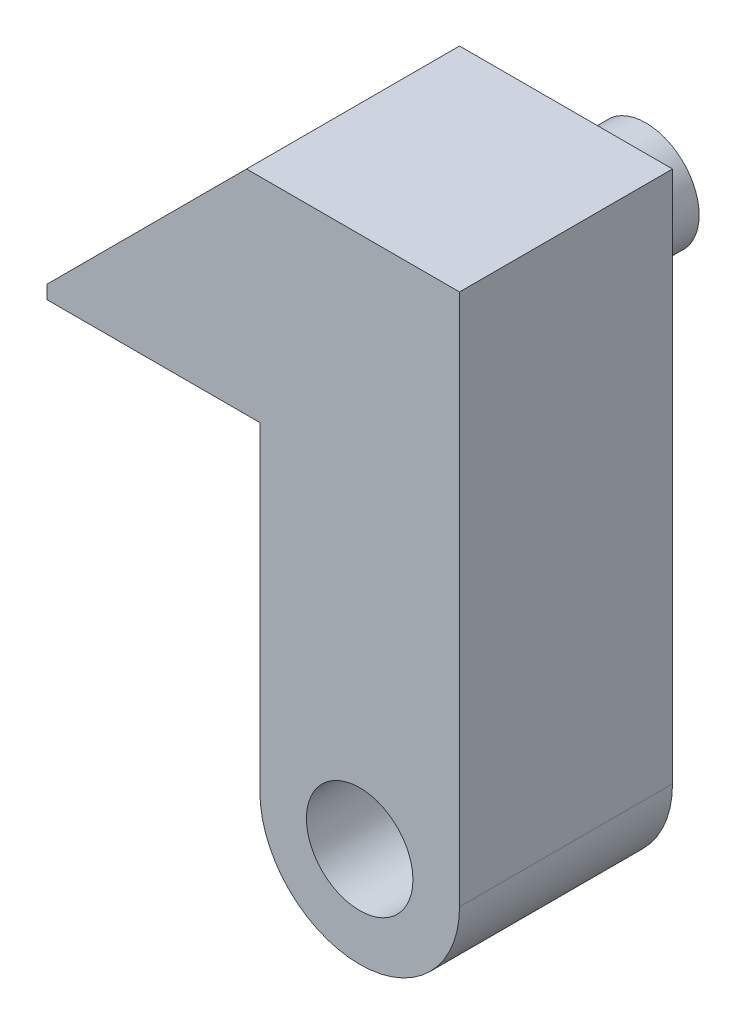
ISO-10303-21;
HEADER;
FILE_DESCRIPTION(('STEP AP214'),'2;1');
FILE_NAME('part.step','',(''),(''),'','','');
FILE_SCHEMA(('AUTOMOTIVE_DESIGN { 1 0 10303 214 1 1 1 1 }'));
ENDSEC;
DATA;
#1=APPLICATION_CONTEXT('core data for automotive mechanical design processes');
#2=APPLICATION_PROTOCOL_DEFINITION('international standard','automotive_design',2000,#1);
#3=PRODUCT_CONTEXT('',#1,'mechanical');
#4=PRODUCT('Part','Part','',(#3));
#5=PRODUCT_RELATED_PRODUCT_CATEGORY('part','',(#4));
#6=PRODUCT_DEFINITION_FORMATION('','',#4);
#7=PRODUCT_DEFINITION_CONTEXT('part definition',#1,'design');
#8=PRODUCT_DEFINITION('design','',#6,#7);
#9=PRODUCT_DEFINITION_SHAPE('','',#8);
#10=(LENGTH_UNIT() NAMED_UNIT(*) SI_UNIT(.MILLI.,.METRE.));
#11=(NAMED_UNIT(*) PLANE_ANGLE_UNIT() SI_UNIT($,.RADIAN.));
#12=(NAMED_UNIT(*) SI_UNIT($,.STERADIAN.) SOLID_ANGLE_UNIT());
#13=UNCERTAINTY_MEASURE_WITH_UNIT(LENGTH_MEASURE(1.E-05),#10,'distance_accuracy_value','');
#14=(GEOMETRIC_REPRESENTATION_CONTEXT(3) GLOBAL_UNCERTAINTY_ASSIGNED_CONTEXT((#13)) GLOBAL_UNIT_ASSIGNED_CONTEXT((#10,
#11,#12)) REPRESENTATION_CONTEXT('',''));
#15=CARTESIAN_POINT('',(0.,0.,0.));
#16=DIRECTION('',(0.,0.,1.));
#17=DIRECTION('',(1.,0.,0.));
#18=AXIS2_PLACEMENT_3D('',#15,#16,#17);
#19=CARTESIAN_POINT('',(5.953125,0.,12.7));
#20=DIRECTION('',(0.,0.,1.));
#21=DIRECTION('',(1.,0.,0.));
#22=AXIS2_PLACEMENT_3D('',#19,#20,#21);
#23=PLANE('',#22);
#24=CARTESIAN_POINT('',(5.953125,0.,12.7));
#25=DIRECTION('',(0.,0.,1.));
#26=DIRECTION('',(1.,0.,0.));
#27=AXIS2_PLACEMENT_3D('',#24,#25,#26);
#28=CIRCLE('',#27,5.953125);
#29=CARTESIAN_POINT('',(0.,0.,12.7));
#30=VERTEX_POINT('',#29);
#31=CARTESIAN_POINT('',(11.90625,0.,12.7));
#32=VERTEX_POINT('',#31);
#33=EDGE_CURVE('E168',#30,#32,#28,.T.);
#34=ORIENTED_EDGE('',*,*,#33,.T.);
#35=DIRECTION('',(0.,1.,0.));
#36=VECTOR('',#35,1.);
#37=CARTESIAN_POINT('',(11.90625,31.75,12.7));
#38=LINE('',#37,#36);
#39=CARTESIAN_POINT('',(11.90625,31.75,12.7));
#40=VERTEX_POINT('',#39);
#41=EDGE_CURVE('E103',#32,#40,#38,.T.);
#42=ORIENTED_EDGE('',*,*,#41,.T.);
#43=DIRECTION('',(-1.,0.,0.));
#44=VECTOR('',#43,1.);
#45=CARTESIAN_POINT('',(-0.793749999999885,31.75,12.7));
#46=LINE('',#45,#44);
#47=CARTESIAN_POINT('',(-0.793749999999885,31.75,12.7));
#48=VERTEX_POINT('',#47);
#49=EDGE_CURVE('E231',#40,#48,#46,.T.);
#50=ORIENTED_EDGE('',*,*,#49,.T.);
#51=DIRECTION('',(-0.707106781186551,-0.707106781186544,0.));
#52=VECTOR('',#51,1.);
#53=CARTESIAN_POINT('',(-12.7,19.84375,12.7));
#54=LINE('',#53,#52);
#55=CARTESIAN_POINT('',(-12.7,19.84375,12.7));
#56=VERTEX_POINT('',#55);
#57=EDGE_CURVE('E122',#48,#56,#54,.T.);
#58=ORIENTED_EDGE('',*,*,#57,.T.);
#59=DIRECTION('',(0.,-1.,0.));
#60=VECTOR('',#59,1.);
#61=CARTESIAN_POINT('',(-12.7,19.05,12.7));
#62=LINE('',#61,#60);
#63=CARTESIAN_POINT('',(-12.7,19.05,12.7));
#64=VERTEX_POINT('',#63);
#65=EDGE_CURVE('E115',#56,#64,#62,.T.);
#66=ORIENTED_EDGE('',*,*,#65,.T.);
#67=DIRECTION('',(1.,0.,0.));
#68=VECTOR('',#67,1.);
#69=CARTESIAN_POINT('',(0.,19.05,12.7));
#70=LINE('',#69,#68);
#71=CARTESIAN_POINT('',(0.,19.05,12.7));
#72=VERTEX_POINT('',#71);
#73=EDGE_CURVE('E119',#64,#72,#70,.T.);
#74=ORIENTED_EDGE('',*,*,#73,.T.);
#75=DIRECTION('',(0.,-1.,0.));
#76=VECTOR('',#75,1.);
#77=CARTESIAN_POINT('',(0.,0.,12.7));
#78=LINE('',#77,#76);
#79=EDGE_CURVE('E64',#72,#30,#78,.T.);
#80=ORIENTED_EDGE('',*,*,#79,.T.);
#81=EDGE_LOOP('',(#34,#42,#50,#58,#66,#74,#80));
#82=FACE_BOUND('',#81,.T.);
#83=CARTESIAN_POINT('',(5.953125,0.,12.7));
#84=DIRECTION('',(0.,0.,1.));
#85=DIRECTION('',(1.,0.,0.));
#86=AXIS2_PLACEMENT_3D('',#83,#84,#85);
#87=CIRCLE('',#86,3.175);
#88=CARTESIAN_POINT('',(9.128125,0.,12.7));
#89=VERTEX_POINT('',#88);
#90=EDGE_CURVE('E152',#89,#89,#87,.T.);
#91=ORIENTED_EDGE('',*,*,#90,.F.);
#92=EDGE_LOOP('',(#91));
#93=FACE_BOUND('',#92,.T.);
#94=ADVANCED_FACE('F39',(#82,#93),#23,.T.);
#95=CARTESIAN_POINT('',(5.953125,0.,0.));
#96=DIRECTION('',(0.,0.,1.));
#97=DIRECTION('',(1.,0.,0.));
#98=AXIS2_PLACEMENT_3D('',#95,#96,#97);
#99=PLANE('',#98);
#100=CARTESIAN_POINT('',(5.55624999999999,25.4,0.));
#101=DIRECTION('',(0.,0.,1.));
#102=DIRECTION('',(1.,0.,0.));
#103=AXIS2_PLACEMENT_3D('',#100,#101,#102);
#104=CIRCLE('',#103,3.175);
#105=CARTESIAN_POINT('',(8.73124999999999,25.4,0.));
#106=VERTEX_POINT('',#105);
#107=EDGE_CURVE('E186',#106,#106,#104,.F.);
#108=ORIENTED_EDGE('',*,*,#107,.F.);
#109=EDGE_LOOP('',(#108));
#110=FACE_BOUND('',#109,.T.);
#111=CARTESIAN_POINT('',(5.953125,0.,0.));
#112=DIRECTION('',(0.,0.,1.));
#113=DIRECTION('',(1.,0.,0.));
#114=AXIS2_PLACEMENT_3D('',#111,#112,#113);
#115=CIRCLE('',#114,5.953125);
#116=CARTESIAN_POINT('',(0.,0.,0.));
#117=VERTEX_POINT('',#116);
#118=CARTESIAN_POINT('',(11.90625,0.,0.));
#119=VERTEX_POINT('',#118);
#120=EDGE_CURVE('E147',#117,#119,#115,.T.);
#121=ORIENTED_EDGE('',*,*,#120,.F.);
#122=DIRECTION('',(0.,-1.,0.));
#123=VECTOR('',#122,1.);
#124=CARTESIAN_POINT('',(0.,0.,0.));
#125=LINE('',#124,#123);
#126=CARTESIAN_POINT('',(0.,19.05,0.));
#127=VERTEX_POINT('',#126);
#128=EDGE_CURVE('E94',#127,#117,#125,.T.);
#129=ORIENTED_EDGE('',*,*,#128,.F.);
#130=DIRECTION('',(1.,0.,0.));
#131=VECTOR('',#130,1.);
#132=CARTESIAN_POINT('',(0.,19.05,0.));
#133=LINE('',#132,#131);
#134=CARTESIAN_POINT('',(-12.7,19.05,0.));
#135=VERTEX_POINT('',#134);
#136=EDGE_CURVE('E163',#135,#127,#133,.T.);
#137=ORIENTED_EDGE('',*,*,#136,.F.);
#138=DIRECTION('',(0.,-1.,0.));
#139=VECTOR('',#138,1.);
#140=CARTESIAN_POINT('',(-12.7,19.05,0.));
#141=LINE('',#140,#139);
#142=CARTESIAN_POINT('',(-12.7,19.84375,0.));
#143=VERTEX_POINT('',#142);
#144=EDGE_CURVE('E132',#143,#135,#141,.T.);
#145=ORIENTED_EDGE('',*,*,#144,.F.);
#146=DIRECTION('',(-0.707106781186551,-0.707106781186544,0.));
#147=VECTOR('',#146,1.);
#148=CARTESIAN_POINT('',(-12.7,19.84375,0.));
#149=LINE('',#148,#147);
#150=CARTESIAN_POINT('',(-0.793749999999885,31.75,0.));
#151=VERTEX_POINT('',#150);
#152=EDGE_CURVE('E158',#151,#143,#149,.T.);
#153=ORIENTED_EDGE('',*,*,#152,.F.);
#154=DIRECTION('',(-1.,0.,0.));
#155=VECTOR('',#154,1.);
#156=CARTESIAN_POINT('',(-0.793749999999885,31.75,0.));
#157=LINE('',#156,#155);
#158=CARTESIAN_POINT('',(11.90625,31.75,0.));
#159=VERTEX_POINT('',#158);
#160=EDGE_CURVE('E155',#159,#151,#157,.T.);
#161=ORIENTED_EDGE('',*,*,#160,.F.);
#162=DIRECTION('',(0.,1.,0.));
#163=VECTOR('',#162,1.);
#164=CARTESIAN_POINT('',(11.90625,31.75,0.));
#165=LINE('',#164,#163);
#166=EDGE_CURVE('E151',#119,#159,#165,.T.);
#167=ORIENTED_EDGE('',*,*,#166,.F.);
#168=EDGE_LOOP('',(#121,#129,#137,#145,#153,#161,#167));
#169=FACE_BOUND('',#168,.T.);
#170=CARTESIAN_POINT('',(5.953125,0.,0.));
#171=DIRECTION('',(0.,0.,1.));
#172=DIRECTION('',(1.,0.,0.));
#173=AXIS2_PLACEMENT_3D('',#170,#171,#172);
#174=CIRCLE('',#173,3.175);
#175=CARTESIAN_POINT('',(9.128125,0.,0.));
#176=VERTEX_POINT('',#175);
#177=EDGE_CURVE('E220',#176,#176,#174,.T.);
#178=ORIENTED_EDGE('',*,*,#177,.T.);
#179=EDGE_LOOP('',(#178));
#180=FACE_BOUND('',#179,.T.);
#181=ADVANCED_FACE('F244',(#110,#169,#180),#99,.F.);
#182=CARTESIAN_POINT('',(5.953125,0.,12.7));
#183=DIRECTION('',(0.,0.,-1.));
#184=DIRECTION('',(-1.,0.,0.));
#185=AXIS2_PLACEMENT_3D('',#182,#183,#184);
#186=CYLINDRICAL_SURFACE('',#185,5.953125);
#187=ORIENTED_EDGE('',*,*,#120,.T.);
#188=DIRECTION('',(0.,0.,-1.));
#189=VECTOR('',#188,1.);
#190=CARTESIAN_POINT('',(11.90625,0.,12.7));
#191=LINE('',#190,#189);
#192=EDGE_CURVE('E183',#32,#119,#191,.T.);
#193=ORIENTED_EDGE('',*,*,#192,.F.);
#194=ORIENTED_EDGE('',*,*,#33,.F.);
#195=DIRECTION('',(0.,0.,-1.));
#196=VECTOR('',#195,1.);
#197=CARTESIAN_POINT('',(0.,0.,12.7));
#198=LINE('',#197,#196);
#199=EDGE_CURVE('E143',#30,#117,#198,.T.);
#200=ORIENTED_EDGE('',*,*,#199,.T.);
#201=EDGE_LOOP('',(#187,#193,#194,#200));
#202=FACE_BOUND('',#201,.T.);
#203=ADVANCED_FACE('F41',(#202),#186,.T.);
#204=CARTESIAN_POINT('',(11.90625,31.75,12.7));
#205=DIRECTION('',(-1.,0.,0.));
#206=DIRECTION('',(0.,-1.,0.));
#207=AXIS2_PLACEMENT_3D('',#204,#205,#206);
#208=PLANE('',#207);
#209=ORIENTED_EDGE('',*,*,#166,.T.);
#210=DIRECTION('',(0.,0.,-1.));
#211=VECTOR('',#210,1.);
#212=CARTESIAN_POINT('',(11.90625,31.75,12.7));
#213=LINE('',#212,#211);
#214=EDGE_CURVE('E179',#40,#159,#213,.T.);
#215=ORIENTED_EDGE('',*,*,#214,.F.);
#216=ORIENTED_EDGE('',*,*,#41,.F.);
#217=ORIENTED_EDGE('',*,*,#192,.T.);
#218=EDGE_LOOP('',(#209,#215,#216,#217));
#219=FACE_BOUND('',#218,.T.);
#220=ADVANCED_FACE('F250',(#219),#208,.F.);
#221=CARTESIAN_POINT('',(-0.793749999999885,31.75,12.7));
#222=DIRECTION('',(0.,-1.,0.));
#223=DIRECTION('',(0.,0.,-1.));
#224=AXIS2_PLACEMENT_3D('',#221,#222,#223);
#225=PLANE('',#224);
#226=ORIENTED_EDGE('',*,*,#160,.T.);
#227=DIRECTION('',(0.,0.,-1.));
#228=VECTOR('',#227,1.);
#229=CARTESIAN_POINT('',(-0.793749999999885,31.75,12.7));
#230=LINE('',#229,#228);
#231=EDGE_CURVE('E175',#48,#151,#230,.T.);
#232=ORIENTED_EDGE('',*,*,#231,.F.);
#233=ORIENTED_EDGE('',*,*,#49,.F.);
#234=ORIENTED_EDGE('',*,*,#214,.T.);
#235=EDGE_LOOP('',(#226,#232,#233,#234));
#236=FACE_BOUND('',#235,.T.);
#237=ADVANCED_FACE('F237',(#236),#225,.F.);
#238=CARTESIAN_POINT('',(-12.7,19.84375,12.7));
#239=DIRECTION('',(0.707106781186544,-0.707106781186551,0.));
#240=DIRECTION('',(0.707106781186551,0.707106781186544,0.));
#241=AXIS2_PLACEMENT_3D('',#238,#239,#240);
#242=PLANE('',#241);
#243=ORIENTED_EDGE('',*,*,#152,.T.);
#244=DIRECTION('',(0.,0.,-1.));
#245=VECTOR('',#244,1.);
#246=CARTESIAN_POINT('',(-12.7,19.84375,12.7));
#247=LINE('',#246,#245);
#248=EDGE_CURVE('E136',#56,#143,#247,.T.);
#249=ORIENTED_EDGE('',*,*,#248,.F.);
#250=ORIENTED_EDGE('',*,*,#57,.F.);
#251=ORIENTED_EDGE('',*,*,#231,.T.);
#252=EDGE_LOOP('',(#243,#249,#250,#251));
#253=FACE_BOUND('',#252,.T.);
#254=ADVANCED_FACE('F241',(#253),#242,.F.);
#255=CARTESIAN_POINT('',(-12.7,19.05,12.7));
#256=DIRECTION('',(1.,0.,0.));
#257=DIRECTION('',(0.,0.,-1.));
#258=AXIS2_PLACEMENT_3D('',#255,#256,#257);
#259=PLANE('',#258);
#260=ORIENTED_EDGE('',*,*,#144,.T.);
#261=DIRECTION('',(0.,0.,-1.));
#262=VECTOR('',#261,1.);
#263=CARTESIAN_POINT('',(-12.7,19.05,12.7));
#264=LINE('',#263,#262);
#265=EDGE_CURVE('E129',#64,#135,#264,.T.);
#266=ORIENTED_EDGE('',*,*,#265,.F.);
#267=ORIENTED_EDGE('',*,*,#65,.F.);
#268=ORIENTED_EDGE('',*,*,#248,.T.);
#269=EDGE_LOOP('',(#260,#266,#267,#268));
#270=FACE_BOUND('',#269,.T.);
#271=ADVANCED_FACE('F130',(#270),#259,.F.);
#272=CARTESIAN_POINT('',(0.,19.05,12.7));
#273=DIRECTION('',(0.,1.,0.));
#274=DIRECTION('',(-1.,0.,0.));
#275=AXIS2_PLACEMENT_3D('',#272,#273,#274);
#276=PLANE('',#275);
#277=ORIENTED_EDGE('',*,*,#136,.T.);
#278=DIRECTION('',(0.,0.,-1.));
#279=VECTOR('',#278,1.);
#280=CARTESIAN_POINT('',(0.,19.05,12.7));
#281=LINE('',#280,#279);
#282=EDGE_CURVE('E137',#72,#127,#281,.T.);
#283=ORIENTED_EDGE('',*,*,#282,.F.);
#284=ORIENTED_EDGE('',*,*,#73,.F.);
#285=ORIENTED_EDGE('',*,*,#265,.T.);
#286=EDGE_LOOP('',(#277,#283,#284,#285));
#287=FACE_BOUND('',#286,.T.);
#288=ADVANCED_FACE('F139',(#287),#276,.F.);
#289=CARTESIAN_POINT('',(0.,0.,12.7));
#290=DIRECTION('',(1.,0.,0.));
#291=DIRECTION('',(0.,1.,0.));
#292=AXIS2_PLACEMENT_3D('',#289,#290,#291);
#293=PLANE('',#292);
#294=ORIENTED_EDGE('',*,*,#128,.T.);
#295=ORIENTED_EDGE('',*,*,#199,.F.);
#296=ORIENTED_EDGE('',*,*,#79,.F.);
#297=ORIENTED_EDGE('',*,*,#282,.T.);
#298=EDGE_LOOP('',(#294,#295,#296,#297));
#299=FACE_BOUND('',#298,.T.);
#300=ADVANCED_FACE('F246',(#299),#293,.F.);
#301=CARTESIAN_POINT('',(5.953125,0.,12.7));
#302=DIRECTION('',(0.,0.,-1.));
#303=DIRECTION('',(-1.,0.,0.));
#304=AXIS2_PLACEMENT_3D('',#301,#302,#303);
#305=CYLINDRICAL_SURFACE('',#304,3.175);
#306=ORIENTED_EDGE('',*,*,#90,.T.);
#307=EDGE_LOOP('',(#306));
#308=FACE_BOUND('',#307,.T.);
#309=ORIENTED_EDGE('',*,*,#177,.F.);
#310=EDGE_LOOP('',(#309));
#311=FACE_BOUND('',#310,.T.);
#312=ADVANCED_FACE('F266',(#308,#311),#305,.F.);
#313=CARTESIAN_POINT('',(5.55624999999999,25.4,-4.7625));
#314=DIRECTION('',(0.,0.,1.));
#315=DIRECTION('',(1.,0.,0.));
#316=AXIS2_PLACEMENT_3D('',#313,#314,#315);
#317=CYLINDRICAL_SURFACE('',#316,3.175);
#318=CARTESIAN_POINT('',(5.55624999999999,25.4,-3.175));
#319=DIRECTION('',(0.,0.,-1.));
#320=DIRECTION('',(-1.,0.,0.));
#321=AXIS2_PLACEMENT_3D('',#318,#319,#320);
#322=CIRCLE('',#321,3.175);
#323=CARTESIAN_POINT('',(5.75507774732455,28.5687682980764,-3.175));
#324=VERTEX_POINT('',#323);
#325=CARTESIAN_POINT('',(8.72501829807637,25.5988277473246,-3.175));
#326=VERTEX_POINT('',#325);
#327=EDGE_CURVE('E48',#324,#326,#322,.T.);
#328=ORIENTED_EDGE('',*,*,#327,.T.);
#329=DIRECTION('',(0.,0.,1.));
#330=VECTOR('',#329,1.);
#331=CARTESIAN_POINT('',(8.72501829807637,25.5988277473246,-4.7625));
#332=LINE('',#331,#330);
#333=CARTESIAN_POINT('',(8.72501829807637,25.5988277473246,-1.5875));
#334=VERTEX_POINT('',#333);
#335=EDGE_CURVE('E11',#326,#334,#332,.T.);
#336=ORIENTED_EDGE('',*,*,#335,.T.);
#337=CARTESIAN_POINT('',(5.55624999999999,25.4,-1.5875));
#338=DIRECTION('',(0.,0.,1.));
#339=DIRECTION('',(1.,0.,0.));
#340=AXIS2_PLACEMENT_3D('',#337,#338,#339);
#341=CIRCLE('',#340,3.175);
#342=CARTESIAN_POINT('',(5.75507774732455,28.5687682980764,-1.5875));
#343=VERTEX_POINT('',#342);
#344=EDGE_CURVE('E194',#334,#343,#341,.T.);
#345=ORIENTED_EDGE('',*,*,#344,.T.);
#346=DIRECTION('',(0.,0.,1.));
#347=VECTOR('',#346,1.);
#348=CARTESIAN_POINT('',(5.75507774732455,28.5687682980764,-4.7625));
#349=LINE('',#348,#347);
#350=EDGE_CURVE('E190',#343,#324,#349,.F.);
#351=ORIENTED_EDGE('',*,*,#350,.T.);
#352=EDGE_LOOP('',(#328,#336,#345,#351));
#353=FACE_BOUND('',#352,.T.);
#354=CARTESIAN_POINT('',(5.55624999999999,25.4,-4.7625));
#355=DIRECTION('',(0.,0.,-1.));
#356=DIRECTION('',(-1.,0.,0.));
#357=AXIS2_PLACEMENT_3D('',#354,#355,#356);
#358=CIRCLE('',#357,3.175);
#359=CARTESIAN_POINT('',(2.38124999999999,25.4,-4.7625));
#360=VERTEX_POINT('',#359);
#361=EDGE_CURVE('E214',#360,#360,#358,.T.);
#362=ORIENTED_EDGE('',*,*,#361,.F.);
#363=EDGE_LOOP('',(#362));
#364=FACE_BOUND('',#363,.T.);
#365=ORIENTED_EDGE('',*,*,#107,.T.);
#366=EDGE_LOOP('',(#365));
#367=FACE_BOUND('',#366,.T.);
#368=ADVANCED_FACE('F201',(#353,#364,#367),#317,.T.);
#369=CARTESIAN_POINT('',(5.55624999999999,25.4,-4.7625));
#370=DIRECTION('',(0.,0.,-1.));
#371=DIRECTION('',(-1.,0.,0.));
#372=AXIS2_PLACEMENT_3D('',#369,#370,#371);
#373=PLANE('',#372);
#374=ORIENTED_EDGE('',*,*,#361,.T.);
#375=EDGE_LOOP('',(#374));
#376=FACE_BOUND('',#375,.T.);
#377=ADVANCED_FACE('F304',(#376),#373,.T.);
#378=CARTESIAN_POINT('',(12.2914420908019,23.1549359697327,-3.175));
#379=DIRECTION('',(0.,0.,-1.));
#380=DIRECTION('',(-1.,0.,0.));
#381=AXIS2_PLACEMENT_3D('',#378,#379,#380);
#382=PLANE('',#381);
#383=DIRECTION('',(-0.707106781186549,0.707106781186546,0.));
#384=VECTOR('',#383,1.);
#385=CARTESIAN_POINT('',(11.730176083235,22.5936699621659,-3.175));
#386=LINE('',#385,#384);
#387=EDGE_CURVE('E55',#326,#324,#386,.T.);
#388=ORIENTED_EDGE('',*,*,#387,.F.);
#389=ORIENTED_EDGE('',*,*,#327,.F.);
#390=EDGE_LOOP('',(#388,#389));
#391=FACE_BOUND('',#390,.T.);
#392=ADVANCED_FACE('F210',(#391),#382,.F.);
#393=CARTESIAN_POINT('',(12.2914420908019,23.1549359697327,-1.5875));
#394=DIRECTION('',(0.,0.,1.));
#395=DIRECTION('',(1.,0.,0.));
#396=AXIS2_PLACEMENT_3D('',#393,#394,#395);
#397=PLANE('',#396);
#398=DIRECTION('',(-0.707106781186549,0.707106781186546,0.));
#399=VECTOR('',#398,1.);
#400=CARTESIAN_POINT('',(11.730176083235,22.5936699621659,-1.5875));
#401=LINE('',#400,#399);
#402=EDGE_CURVE('E209',#334,#343,#401,.T.);
#403=ORIENTED_EDGE('',*,*,#402,.T.);
#404=ORIENTED_EDGE('',*,*,#344,.F.);
#405=EDGE_LOOP('',(#403,#404));
#406=FACE_BOUND('',#405,.T.);
#407=ADVANCED_FACE('F317',(#406),#397,.F.);
#408=CARTESIAN_POINT('',(11.730176083235,22.5936699621659,-3.175));
#409=DIRECTION('',(-0.707106781186546,-0.707106781186549,0.));
#410=DIRECTION('',(0.707106781186549,-0.707106781186546,0.));
#411=AXIS2_PLACEMENT_3D('',#408,#409,#410);
#412=PLANE('',#411);
#413=ORIENTED_EDGE('',*,*,#387,.T.);
#414=ORIENTED_EDGE('',*,*,#350,.F.);
#415=ORIENTED_EDGE('',*,*,#402,.F.);
#416=ORIENTED_EDGE('',*,*,#335,.F.);
#417=EDGE_LOOP('',(#413,#414,#415,#416));
#418=FACE_BOUND('',#417,.T.);
#419=ADVANCED_FACE('F207',(#418),#412,.F.);
#420=CLOSED_SHELL('',(#94,#181,#203,#220,#237,#254,#271,#288,#300,#312,#368,#377,#392,#407,#419));
#421=MANIFOLD_SOLID_BREP('B2',#420);
#422=ADVANCED_BREP_SHAPE_REPRESENTATION('',(#18,#421),#14);
#423=SHAPE_DEFINITION_REPRESENTATION(#9,#422);
ENDSEC;
END-ISO-10303-21;
